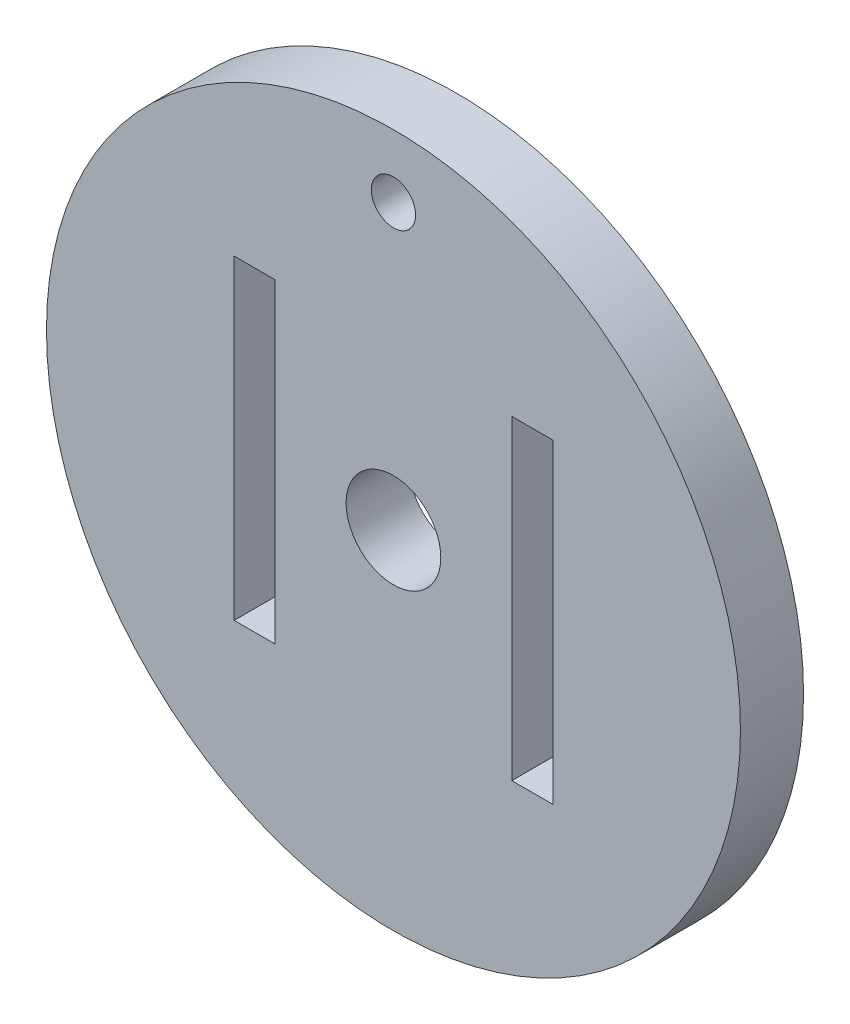
ISO-10303-21;
HEADER;
FILE_DESCRIPTION(('STEP AP214'),'2;1');
FILE_NAME('part.step','',(''),(''),'','','');
FILE_SCHEMA(('AUTOMOTIVE_DESIGN { 1 0 10303 214 1 1 1 1 }'));
ENDSEC;
DATA;
#1=APPLICATION_CONTEXT('core data for automotive mechanical design processes');
#2=APPLICATION_PROTOCOL_DEFINITION('international standard','automotive_design',2000,#1);
#3=PRODUCT_CONTEXT('',#1,'mechanical');
#4=PRODUCT('Part','Part','',(#3));
#5=PRODUCT_RELATED_PRODUCT_CATEGORY('part','',(#4));
#6=PRODUCT_DEFINITION_FORMATION('','',#4);
#7=PRODUCT_DEFINITION_CONTEXT('part definition',#1,'design');
#8=PRODUCT_DEFINITION('design','',#6,#7);
#9=PRODUCT_DEFINITION_SHAPE('','',#8);
#10=(LENGTH_UNIT() NAMED_UNIT(*) SI_UNIT(.MILLI.,.METRE.));
#11=(NAMED_UNIT(*) PLANE_ANGLE_UNIT() SI_UNIT($,.RADIAN.));
#12=(NAMED_UNIT(*) SI_UNIT($,.STERADIAN.) SOLID_ANGLE_UNIT());
#13=UNCERTAINTY_MEASURE_WITH_UNIT(LENGTH_MEASURE(1.E-05),#10,'distance_accuracy_value','');
#14=(GEOMETRIC_REPRESENTATION_CONTEXT(3) GLOBAL_UNCERTAINTY_ASSIGNED_CONTEXT((#13)) GLOBAL_UNIT_ASSIGNED_CONTEXT((#10,
#11,#12)) REPRESENTATION_CONTEXT('',''));
#15=CARTESIAN_POINT('',(0.,0.,0.));
#16=DIRECTION('',(0.,0.,1.));
#17=DIRECTION('',(1.,0.,0.));
#18=AXIS2_PLACEMENT_3D('',#15,#16,#17);
#19=CARTESIAN_POINT('',(0.,0.,2.));
#20=DIRECTION('',(0.,0.,1.));
#21=DIRECTION('',(1.,0.,0.));
#22=AXIS2_PLACEMENT_3D('',#19,#20,#21);
#23=PLANE('',#22);
#24=DIRECTION('',(1.,0.,0.));
#25=VECTOR('',#24,1.);
#26=CARTESIAN_POINT('',(-5.05,-5.,2.));
#27=LINE('',#26,#25);
#28=CARTESIAN_POINT('',(-5.05,-5.,2.));
#29=VERTEX_POINT('',#28);
#30=CARTESIAN_POINT('',(-3.75,-5.,2.));
#31=VERTEX_POINT('',#30);
#32=EDGE_CURVE('E136',#29,#31,#27,.T.);
#33=ORIENTED_EDGE('',*,*,#32,.F.);
#34=DIRECTION('',(0.,-1.,0.));
#35=VECTOR('',#34,1.);
#36=CARTESIAN_POINT('',(-5.05,5.,2.));
#37=LINE('',#36,#35);
#38=CARTESIAN_POINT('',(-5.05,5.,2.));
#39=VERTEX_POINT('',#38);
#40=EDGE_CURVE('E134',#39,#29,#37,.T.);
#41=ORIENTED_EDGE('',*,*,#40,.F.);
#42=DIRECTION('',(-1.,0.,0.));
#43=VECTOR('',#42,1.);
#44=CARTESIAN_POINT('',(-5.05,5.,2.));
#45=LINE('',#44,#43);
#46=CARTESIAN_POINT('',(-3.75,5.,2.));
#47=VERTEX_POINT('',#46);
#48=EDGE_CURVE('E142',#47,#39,#45,.T.);
#49=ORIENTED_EDGE('',*,*,#48,.F.);
#50=DIRECTION('',(0.,1.,0.));
#51=VECTOR('',#50,1.);
#52=CARTESIAN_POINT('',(-3.75,5.,2.));
#53=LINE('',#52,#51);
#54=EDGE_CURVE('E139',#31,#47,#53,.T.);
#55=ORIENTED_EDGE('',*,*,#54,.F.);
#56=EDGE_LOOP('',(#33,#41,#49,#55));
#57=FACE_BOUND('',#56,.T.);
#58=CARTESIAN_POINT('',(0.,0.,2.));
#59=DIRECTION('',(0.,0.,1.));
#60=DIRECTION('',(1.,0.,0.));
#61=AXIS2_PLACEMENT_3D('',#58,#59,#60);
#62=CIRCLE('',#61,1.5);
#63=CARTESIAN_POINT('',(1.5,0.,2.));
#64=VERTEX_POINT('',#63);
#65=EDGE_CURVE('E171',#64,#64,#62,.T.);
#66=ORIENTED_EDGE('',*,*,#65,.F.);
#67=EDGE_LOOP('',(#66));
#68=FACE_BOUND('',#67,.T.);
#69=CARTESIAN_POINT('',(0.,0.,2.));
#70=DIRECTION('',(0.,0.,1.));
#71=DIRECTION('',(1.,0.,0.));
#72=AXIS2_PLACEMENT_3D('',#69,#70,#71);
#73=CIRCLE('',#72,10.9999999999456);
#74=CARTESIAN_POINT('',(10.9999999999456,0.,2.));
#75=VERTEX_POINT('',#74);
#76=EDGE_CURVE('E11',#75,#75,#73,.T.);
#77=ORIENTED_EDGE('',*,*,#76,.T.);
#78=EDGE_LOOP('',(#77));
#79=FACE_BOUND('',#78,.T.);
#80=CARTESIAN_POINT('',(0.,9.,2.));
#81=DIRECTION('',(0.,0.,1.));
#82=DIRECTION('',(1.,0.,0.));
#83=AXIS2_PLACEMENT_3D('',#80,#81,#82);
#84=CIRCLE('',#83,0.7);
#85=CARTESIAN_POINT('',(0.7,9.,2.));
#86=VERTEX_POINT('',#85);
#87=EDGE_CURVE('E165',#86,#86,#84,.T.);
#88=ORIENTED_EDGE('',*,*,#87,.F.);
#89=EDGE_LOOP('',(#88));
#90=FACE_BOUND('',#89,.T.);
#91=DIRECTION('',(1.,0.,0.));
#92=VECTOR('',#91,1.);
#93=CARTESIAN_POINT('',(3.75,-5.,2.));
#94=LINE('',#93,#92);
#95=CARTESIAN_POINT('',(3.75,-5.,2.));
#96=VERTEX_POINT('',#95);
#97=CARTESIAN_POINT('',(5.05,-5.,2.));
#98=VERTEX_POINT('',#97);
#99=EDGE_CURVE('E106',#96,#98,#94,.T.);
#100=ORIENTED_EDGE('',*,*,#99,.F.);
#101=DIRECTION('',(0.,-1.,0.));
#102=VECTOR('',#101,1.);
#103=CARTESIAN_POINT('',(3.75,5.,2.));
#104=LINE('',#103,#102);
#105=CARTESIAN_POINT('',(3.75,5.,2.));
#106=VERTEX_POINT('',#105);
#107=EDGE_CURVE('E98',#106,#96,#104,.T.);
#108=ORIENTED_EDGE('',*,*,#107,.F.);
#109=DIRECTION('',(-1.,0.,0.));
#110=VECTOR('',#109,1.);
#111=CARTESIAN_POINT('',(3.75,5.,2.));
#112=LINE('',#111,#110);
#113=CARTESIAN_POINT('',(5.05,5.,2.));
#114=VERTEX_POINT('',#113);
#115=EDGE_CURVE('E120',#114,#106,#112,.T.);
#116=ORIENTED_EDGE('',*,*,#115,.F.);
#117=DIRECTION('',(0.,1.,0.));
#118=VECTOR('',#117,1.);
#119=CARTESIAN_POINT('',(5.05,5.,2.));
#120=LINE('',#119,#118);
#121=EDGE_CURVE('E118',#98,#114,#120,.T.);
#122=ORIENTED_EDGE('',*,*,#121,.F.);
#123=EDGE_LOOP('',(#100,#108,#116,#122));
#124=FACE_BOUND('',#123,.T.);
#125=ADVANCED_FACE('F33',(#57,#68,#79,#90,#124),#23,.T.);
#126=CARTESIAN_POINT('',(0.,0.,0.));
#127=DIRECTION('',(0.,0.,1.));
#128=DIRECTION('',(1.,0.,0.));
#129=AXIS2_PLACEMENT_3D('',#126,#127,#128);
#130=PLANE('',#129);
#131=DIRECTION('',(0.,-1.,0.));
#132=VECTOR('',#131,1.);
#133=CARTESIAN_POINT('',(-5.05,5.,0.));
#134=LINE('',#133,#132);
#135=CARTESIAN_POINT('',(-5.05,5.,0.));
#136=VERTEX_POINT('',#135);
#137=CARTESIAN_POINT('',(-5.05,-5.,0.));
#138=VERTEX_POINT('',#137);
#139=EDGE_CURVE('E114',#136,#138,#134,.T.);
#140=ORIENTED_EDGE('',*,*,#139,.T.);
#141=DIRECTION('',(1.,0.,0.));
#142=VECTOR('',#141,1.);
#143=CARTESIAN_POINT('',(-5.05,-5.,0.));
#144=LINE('',#143,#142);
#145=CARTESIAN_POINT('',(-3.75,-5.,0.));
#146=VERTEX_POINT('',#145);
#147=EDGE_CURVE('E147',#138,#146,#144,.T.);
#148=ORIENTED_EDGE('',*,*,#147,.T.);
#149=DIRECTION('',(0.,1.,0.));
#150=VECTOR('',#149,1.);
#151=CARTESIAN_POINT('',(-3.75,5.,0.));
#152=LINE('',#151,#150);
#153=CARTESIAN_POINT('',(-3.75,5.,0.));
#154=VERTEX_POINT('',#153);
#155=EDGE_CURVE('E150',#146,#154,#152,.T.);
#156=ORIENTED_EDGE('',*,*,#155,.T.);
#157=DIRECTION('',(-1.,0.,0.));
#158=VECTOR('',#157,1.);
#159=CARTESIAN_POINT('',(-5.05,5.,0.));
#160=LINE('',#159,#158);
#161=EDGE_CURVE('E137',#154,#136,#160,.T.);
#162=ORIENTED_EDGE('',*,*,#161,.T.);
#163=EDGE_LOOP('',(#140,#148,#156,#162));
#164=FACE_BOUND('',#163,.T.);
#165=CARTESIAN_POINT('',(0.,0.,0.));
#166=DIRECTION('',(0.,0.,1.));
#167=DIRECTION('',(1.,0.,0.));
#168=AXIS2_PLACEMENT_3D('',#165,#166,#167);
#169=CIRCLE('',#168,1.5);
#170=CARTESIAN_POINT('',(1.5,0.,0.));
#171=VERTEX_POINT('',#170);
#172=EDGE_CURVE('E168',#171,#171,#169,.T.);
#173=ORIENTED_EDGE('',*,*,#172,.T.);
#174=EDGE_LOOP('',(#173));
#175=FACE_BOUND('',#174,.T.);
#176=CARTESIAN_POINT('',(0.,0.,0.));
#177=DIRECTION('',(0.,0.,1.));
#178=DIRECTION('',(1.,0.,0.));
#179=AXIS2_PLACEMENT_3D('',#176,#177,#178);
#180=CIRCLE('',#179,10.9999999999456);
#181=CARTESIAN_POINT('',(10.9999999999456,0.,0.));
#182=VERTEX_POINT('',#181);
#183=EDGE_CURVE('E37',#182,#182,#180,.T.);
#184=ORIENTED_EDGE('',*,*,#183,.F.);
#185=EDGE_LOOP('',(#184));
#186=FACE_BOUND('',#185,.T.);
#187=CARTESIAN_POINT('',(0.,9.,0.));
#188=DIRECTION('',(0.,0.,1.));
#189=DIRECTION('',(1.,0.,0.));
#190=AXIS2_PLACEMENT_3D('',#187,#188,#189);
#191=CIRCLE('',#190,0.7);
#192=CARTESIAN_POINT('',(0.7,9.,0.));
#193=VERTEX_POINT('',#192);
#194=EDGE_CURVE('E164',#193,#193,#191,.T.);
#195=ORIENTED_EDGE('',*,*,#194,.T.);
#196=EDGE_LOOP('',(#195));
#197=FACE_BOUND('',#196,.T.);
#198=DIRECTION('',(0.,-1.,0.));
#199=VECTOR('',#198,1.);
#200=CARTESIAN_POINT('',(3.75,5.,0.));
#201=LINE('',#200,#199);
#202=CARTESIAN_POINT('',(3.75,5.,0.));
#203=VERTEX_POINT('',#202);
#204=CARTESIAN_POINT('',(3.75,-5.,0.));
#205=VERTEX_POINT('',#204);
#206=EDGE_CURVE('E56',#203,#205,#201,.T.);
#207=ORIENTED_EDGE('',*,*,#206,.T.);
#208=DIRECTION('',(1.,0.,0.));
#209=VECTOR('',#208,1.);
#210=CARTESIAN_POINT('',(3.75,-5.,0.));
#211=LINE('',#210,#209);
#212=CARTESIAN_POINT('',(5.05,-5.,0.));
#213=VERTEX_POINT('',#212);
#214=EDGE_CURVE('E113',#205,#213,#211,.T.);
#215=ORIENTED_EDGE('',*,*,#214,.T.);
#216=DIRECTION('',(0.,1.,0.));
#217=VECTOR('',#216,1.);
#218=CARTESIAN_POINT('',(5.05,5.,0.));
#219=LINE('',#218,#217);
#220=CARTESIAN_POINT('',(5.05,5.,0.));
#221=VERTEX_POINT('',#220);
#222=EDGE_CURVE('E126',#213,#221,#219,.T.);
#223=ORIENTED_EDGE('',*,*,#222,.T.);
#224=DIRECTION('',(-1.,0.,0.));
#225=VECTOR('',#224,1.);
#226=CARTESIAN_POINT('',(3.75,5.,0.));
#227=LINE('',#226,#225);
#228=EDGE_CURVE('E107',#221,#203,#227,.T.);
#229=ORIENTED_EDGE('',*,*,#228,.T.);
#230=EDGE_LOOP('',(#207,#215,#223,#229));
#231=FACE_BOUND('',#230,.T.);
#232=ADVANCED_FACE('F177',(#164,#175,#186,#197,#231),#130,.F.);
#233=CARTESIAN_POINT('',(0.,0.,2.));
#234=DIRECTION('',(0.,0.,-1.));
#235=DIRECTION('',(-1.,0.,0.));
#236=AXIS2_PLACEMENT_3D('',#233,#234,#235);
#237=CYLINDRICAL_SURFACE('',#236,10.9999999999456);
#238=ORIENTED_EDGE('',*,*,#76,.F.);
#239=EDGE_LOOP('',(#238));
#240=FACE_BOUND('',#239,.T.);
#241=ORIENTED_EDGE('',*,*,#183,.T.);
#242=EDGE_LOOP('',(#241));
#243=FACE_BOUND('',#242,.T.);
#244=ADVANCED_FACE('F35',(#240,#243),#237,.T.);
#245=CARTESIAN_POINT('',(0.,0.,2.));
#246=DIRECTION('',(0.,0.,-1.));
#247=DIRECTION('',(-1.,0.,0.));
#248=AXIS2_PLACEMENT_3D('',#245,#246,#247);
#249=CYLINDRICAL_SURFACE('',#248,1.5);
#250=ORIENTED_EDGE('',*,*,#65,.T.);
#251=EDGE_LOOP('',(#250));
#252=FACE_BOUND('',#251,.T.);
#253=ORIENTED_EDGE('',*,*,#172,.F.);
#254=EDGE_LOOP('',(#253));
#255=FACE_BOUND('',#254,.T.);
#256=ADVANCED_FACE('F180',(#252,#255),#249,.F.);
#257=CARTESIAN_POINT('',(0.,9.,2.));
#258=DIRECTION('',(0.,0.,-1.));
#259=DIRECTION('',(-1.,0.,0.));
#260=AXIS2_PLACEMENT_3D('',#257,#258,#259);
#261=CYLINDRICAL_SURFACE('',#260,0.7);
#262=ORIENTED_EDGE('',*,*,#87,.T.);
#263=EDGE_LOOP('',(#262));
#264=FACE_BOUND('',#263,.T.);
#265=ORIENTED_EDGE('',*,*,#194,.F.);
#266=EDGE_LOOP('',(#265));
#267=FACE_BOUND('',#266,.T.);
#268=ADVANCED_FACE('F182',(#264,#267),#261,.F.);
#269=CARTESIAN_POINT('',(-5.05,5.,2.));
#270=DIRECTION('',(1.,0.,0.));
#271=DIRECTION('',(0.,1.,0.));
#272=AXIS2_PLACEMENT_3D('',#269,#270,#271);
#273=PLANE('',#272);
#274=ORIENTED_EDGE('',*,*,#139,.F.);
#275=DIRECTION('',(0.,0.,-1.));
#276=VECTOR('',#275,1.);
#277=CARTESIAN_POINT('',(-5.05,5.,2.));
#278=LINE('',#277,#276);
#279=EDGE_CURVE('E144',#39,#136,#278,.T.);
#280=ORIENTED_EDGE('',*,*,#279,.F.);
#281=ORIENTED_EDGE('',*,*,#40,.T.);
#282=DIRECTION('',(0.,0.,-1.));
#283=VECTOR('',#282,1.);
#284=CARTESIAN_POINT('',(-5.05,-5.,2.));
#285=LINE('',#284,#283);
#286=EDGE_CURVE('E161',#29,#138,#285,.T.);
#287=ORIENTED_EDGE('',*,*,#286,.T.);
#288=EDGE_LOOP('',(#274,#280,#281,#287));
#289=FACE_BOUND('',#288,.T.);
#290=ADVANCED_FACE('F189',(#289),#273,.T.);
#291=CARTESIAN_POINT('',(-5.05,-5.,2.));
#292=DIRECTION('',(0.,1.,0.));
#293=DIRECTION('',(0.,0.,1.));
#294=AXIS2_PLACEMENT_3D('',#291,#292,#293);
#295=PLANE('',#294);
#296=ORIENTED_EDGE('',*,*,#147,.F.);
#297=ORIENTED_EDGE('',*,*,#286,.F.);
#298=ORIENTED_EDGE('',*,*,#32,.T.);
#299=DIRECTION('',(0.,0.,-1.));
#300=VECTOR('',#299,1.);
#301=CARTESIAN_POINT('',(-3.75,-5.,2.));
#302=LINE('',#301,#300);
#303=EDGE_CURVE('E159',#31,#146,#302,.T.);
#304=ORIENTED_EDGE('',*,*,#303,.T.);
#305=EDGE_LOOP('',(#296,#297,#298,#304));
#306=FACE_BOUND('',#305,.T.);
#307=ADVANCED_FACE('F235',(#306),#295,.T.);
#308=CARTESIAN_POINT('',(-3.75,5.,2.));
#309=DIRECTION('',(-1.,0.,0.));
#310=DIRECTION('',(0.,-1.,0.));
#311=AXIS2_PLACEMENT_3D('',#308,#309,#310);
#312=PLANE('',#311);
#313=ORIENTED_EDGE('',*,*,#155,.F.);
#314=ORIENTED_EDGE('',*,*,#303,.F.);
#315=ORIENTED_EDGE('',*,*,#54,.T.);
#316=DIRECTION('',(0.,0.,-1.));
#317=VECTOR('',#316,1.);
#318=CARTESIAN_POINT('',(-3.75,5.,2.));
#319=LINE('',#318,#317);
#320=EDGE_CURVE('E157',#47,#154,#319,.T.);
#321=ORIENTED_EDGE('',*,*,#320,.T.);
#322=EDGE_LOOP('',(#313,#314,#315,#321));
#323=FACE_BOUND('',#322,.T.);
#324=ADVANCED_FACE('F231',(#323),#312,.T.);
#325=CARTESIAN_POINT('',(-5.05,5.,2.));
#326=DIRECTION('',(0.,-1.,0.));
#327=DIRECTION('',(0.,0.,-1.));
#328=AXIS2_PLACEMENT_3D('',#325,#326,#327);
#329=PLANE('',#328);
#330=ORIENTED_EDGE('',*,*,#161,.F.);
#331=ORIENTED_EDGE('',*,*,#320,.F.);
#332=ORIENTED_EDGE('',*,*,#48,.T.);
#333=ORIENTED_EDGE('',*,*,#279,.T.);
#334=EDGE_LOOP('',(#330,#331,#332,#333));
#335=FACE_BOUND('',#334,.T.);
#336=ADVANCED_FACE('F228',(#335),#329,.T.);
#337=CARTESIAN_POINT('',(3.75,5.,2.));
#338=DIRECTION('',(1.,0.,0.));
#339=DIRECTION('',(0.,1.,0.));
#340=AXIS2_PLACEMENT_3D('',#337,#338,#339);
#341=PLANE('',#340);
#342=ORIENTED_EDGE('',*,*,#206,.F.);
#343=DIRECTION('',(0.,0.,-1.));
#344=VECTOR('',#343,1.);
#345=CARTESIAN_POINT('',(3.75,5.,2.));
#346=LINE('',#345,#344);
#347=EDGE_CURVE('E102',#106,#203,#346,.T.);
#348=ORIENTED_EDGE('',*,*,#347,.F.);
#349=ORIENTED_EDGE('',*,*,#107,.T.);
#350=DIRECTION('',(0.,0.,-1.));
#351=VECTOR('',#350,1.);
#352=CARTESIAN_POINT('',(3.75,-5.,2.));
#353=LINE('',#352,#351);
#354=EDGE_CURVE('E101',#96,#205,#353,.T.);
#355=ORIENTED_EDGE('',*,*,#354,.T.);
#356=EDGE_LOOP('',(#342,#348,#349,#355));
#357=FACE_BOUND('',#356,.T.);
#358=ADVANCED_FACE('F100',(#357),#341,.T.);
#359=CARTESIAN_POINT('',(3.75,-5.,2.));
#360=DIRECTION('',(0.,1.,0.));
#361=DIRECTION('',(0.,0.,1.));
#362=AXIS2_PLACEMENT_3D('',#359,#360,#361);
#363=PLANE('',#362);
#364=ORIENTED_EDGE('',*,*,#214,.F.);
#365=ORIENTED_EDGE('',*,*,#354,.F.);
#366=ORIENTED_EDGE('',*,*,#99,.T.);
#367=DIRECTION('',(0.,0.,-1.));
#368=VECTOR('',#367,1.);
#369=CARTESIAN_POINT('',(5.05,-5.,2.));
#370=LINE('',#369,#368);
#371=EDGE_CURVE('E115',#98,#213,#370,.T.);
#372=ORIENTED_EDGE('',*,*,#371,.T.);
#373=EDGE_LOOP('',(#364,#365,#366,#372));
#374=FACE_BOUND('',#373,.T.);
#375=ADVANCED_FACE('F110',(#374),#363,.T.);
#376=CARTESIAN_POINT('',(5.05,5.,2.));
#377=DIRECTION('',(-1.,0.,0.));
#378=DIRECTION('',(0.,-1.,0.));
#379=AXIS2_PLACEMENT_3D('',#376,#377,#378);
#380=PLANE('',#379);
#381=ORIENTED_EDGE('',*,*,#222,.F.);
#382=ORIENTED_EDGE('',*,*,#371,.F.);
#383=ORIENTED_EDGE('',*,*,#121,.T.);
#384=DIRECTION('',(0.,0.,-1.));
#385=VECTOR('',#384,1.);
#386=CARTESIAN_POINT('',(5.05,5.,2.));
#387=LINE('',#386,#385);
#388=EDGE_CURVE('E48',#114,#221,#387,.T.);
#389=ORIENTED_EDGE('',*,*,#388,.T.);
#390=EDGE_LOOP('',(#381,#382,#383,#389));
#391=FACE_BOUND('',#390,.T.);
#392=ADVANCED_FACE('F216',(#391),#380,.T.);
#393=CARTESIAN_POINT('',(3.75,5.,2.));
#394=DIRECTION('',(0.,-1.,0.));
#395=DIRECTION('',(1.,0.,0.));
#396=AXIS2_PLACEMENT_3D('',#393,#394,#395);
#397=PLANE('',#396);
#398=ORIENTED_EDGE('',*,*,#228,.F.);
#399=ORIENTED_EDGE('',*,*,#388,.F.);
#400=ORIENTED_EDGE('',*,*,#115,.T.);
#401=ORIENTED_EDGE('',*,*,#347,.T.);
#402=EDGE_LOOP('',(#398,#399,#400,#401));
#403=FACE_BOUND('',#402,.T.);
#404=ADVANCED_FACE('F214',(#403),#397,.T.);
#405=CLOSED_SHELL('',(#125,#232,#244,#256,#268,#290,#307,#324,#336,#358,#375,#392,#404));
#406=MANIFOLD_SOLID_BREP('B2',#405);
#407=ADVANCED_BREP_SHAPE_REPRESENTATION('',(#18,#406),#14);
#408=SHAPE_DEFINITION_REPRESENTATION(#9,#407);
ENDSEC;
END-ISO-10303-21;
